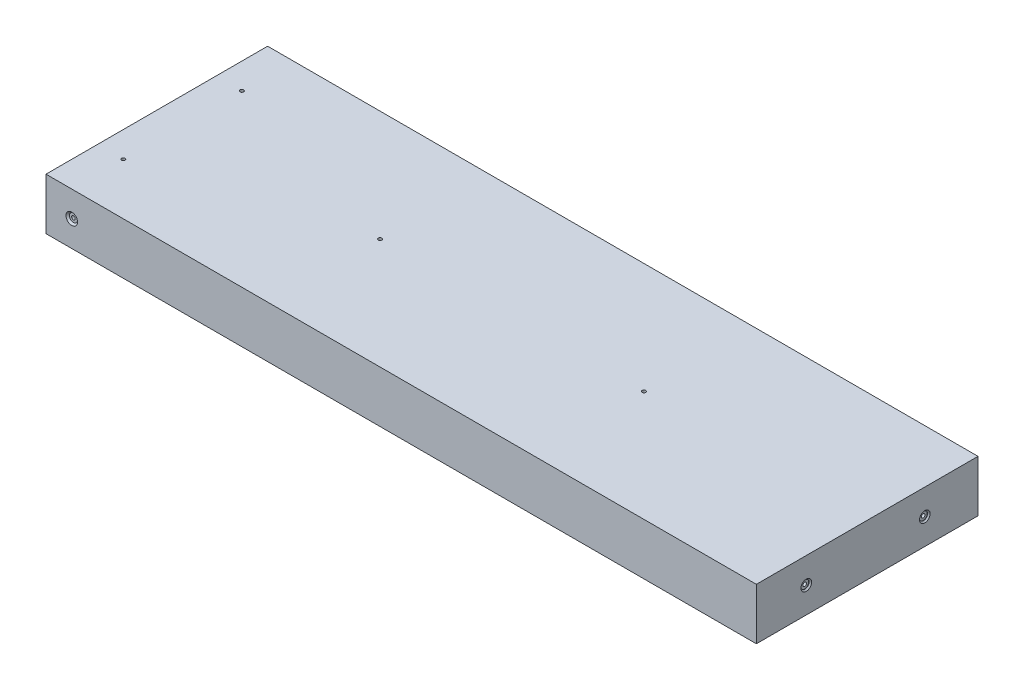
ISO-10303-21;
HEADER;
FILE_DESCRIPTION(('STEP AP214'),'2;1');
FILE_NAME('part.step','',(''),(''),'','','');
FILE_SCHEMA(('AUTOMOTIVE_DESIGN { 1 0 10303 214 1 1 1 1 }'));
ENDSEC;
DATA;
#1=APPLICATION_CONTEXT('core data for automotive mechanical design processes');
#2=APPLICATION_PROTOCOL_DEFINITION('international standard','automotive_design',2000,#1);
#3=PRODUCT_CONTEXT('',#1,'mechanical');
#4=PRODUCT('Part','Part','',(#3));
#5=PRODUCT_RELATED_PRODUCT_CATEGORY('part','',(#4));
#6=PRODUCT_DEFINITION_FORMATION('','',#4);
#7=PRODUCT_DEFINITION_CONTEXT('part definition',#1,'design');
#8=PRODUCT_DEFINITION('design','',#6,#7);
#9=PRODUCT_DEFINITION_SHAPE('','',#8);
#10=(LENGTH_UNIT() NAMED_UNIT(*) SI_UNIT(.MILLI.,.METRE.));
#11=(NAMED_UNIT(*) PLANE_ANGLE_UNIT() SI_UNIT($,.RADIAN.));
#12=(NAMED_UNIT(*) SI_UNIT($,.STERADIAN.) SOLID_ANGLE_UNIT());
#13=UNCERTAINTY_MEASURE_WITH_UNIT(LENGTH_MEASURE(1.E-05),#10,'distance_accuracy_value','');
#14=(GEOMETRIC_REPRESENTATION_CONTEXT(3) GLOBAL_UNCERTAINTY_ASSIGNED_CONTEXT((#13)) GLOBAL_UNIT_ASSIGNED_CONTEXT((#10,
#11,#12)) REPRESENTATION_CONTEXT('',''));
#15=CARTESIAN_POINT('',(0.,0.,0.));
#16=DIRECTION('',(0.,0.,1.));
#17=DIRECTION('',(1.,0.,0.));
#18=AXIS2_PLACEMENT_3D('',#15,#16,#17);
#19=CARTESIAN_POINT('',(-162.3,12.7,-54.6));
#20=DIRECTION('',(0.,0.,-1.));
#21=DIRECTION('',(-1.,0.,0.));
#22=AXIS2_PLACEMENT_3D('',#19,#20,#21);
#23=CYLINDRICAL_SURFACE('',#22,0.889000000000001);
#24=CARTESIAN_POINT('',(-162.3,12.7,-53.7872));
#25=DIRECTION('',(0.,0.,-1.));
#26=DIRECTION('',(-1.,0.,0.));
#27=AXIS2_PLACEMENT_3D('',#24,#25,#26);
#28=CIRCLE('',#27,0.889000000000001);
#29=CARTESIAN_POINT('',(-163.189,12.7,-53.7872));
#30=VERTEX_POINT('',#29);
#31=EDGE_CURVE('E177',#30,#30,#28,.T.);
#32=ORIENTED_EDGE('',*,*,#31,.T.);
#33=EDGE_LOOP('',(#32));
#34=FACE_BOUND('',#33,.T.);
#35=CARTESIAN_POINT('',(-162.3,12.7,-29.2));
#36=DIRECTION('',(0.,0.707106781186547,-0.707106781186547));
#37=DIRECTION('',(0.,-0.707106781186547,-0.707106781186547));
#38=AXIS2_PLACEMENT_3D('',#35,#36,#37);
#39=ELLIPSE('',#38,1.25723585694968,0.889000000000001);
#40=CARTESIAN_POINT('',(-163.189,12.7,-29.2));
#41=VERTEX_POINT('',#40);
#42=CARTESIAN_POINT('',(-161.411,12.7,-29.2));
#43=VERTEX_POINT('',#42);
#44=EDGE_CURVE('E46',#41,#43,#39,.F.);
#45=ORIENTED_EDGE('',*,*,#44,.T.);
#46=CARTESIAN_POINT('',(-162.3,12.7,-29.2));
#47=DIRECTION('',(0.,-0.707106781186547,-0.707106781186547));
#48=DIRECTION('',(0.,0.707106781186547,-0.707106781186547));
#49=AXIS2_PLACEMENT_3D('',#46,#47,#48);
#50=ELLIPSE('',#49,1.25723585694968,0.889000000000001);
#51=EDGE_CURVE('E11',#43,#41,#50,.F.);
#52=ORIENTED_EDGE('',*,*,#51,.T.);
#53=EDGE_LOOP('',(#45,#52));
#54=FACE_BOUND('',#53,.T.);
#55=ADVANCED_FACE('F33',(#34,#54),#23,.F.);
#56=CARTESIAN_POINT('',(-162.3,12.7,54.6));
#57=DIRECTION('',(0.,0.,1.));
#58=DIRECTION('',(1.,0.,0.));
#59=AXIS2_PLACEMENT_3D('',#56,#57,#58);
#60=CYLINDRICAL_SURFACE('',#59,0.889000000000001);
#61=CARTESIAN_POINT('',(-162.3,12.7,53.7872));
#62=DIRECTION('',(0.,0.,1.));
#63=DIRECTION('',(1.,0.,0.));
#64=AXIS2_PLACEMENT_3D('',#61,#62,#63);
#65=CIRCLE('',#64,0.889000000000001);
#66=CARTESIAN_POINT('',(-161.411,12.7,53.7872));
#67=VERTEX_POINT('',#66);
#68=EDGE_CURVE('E162',#67,#67,#65,.T.);
#69=ORIENTED_EDGE('',*,*,#68,.T.);
#70=EDGE_LOOP('',(#69));
#71=FACE_BOUND('',#70,.T.);
#72=CARTESIAN_POINT('',(-162.3,12.7,29.2));
#73=DIRECTION('',(0.,0.707106781186547,0.707106781186547));
#74=DIRECTION('',(0.,-0.707106781186547,0.707106781186547));
#75=AXIS2_PLACEMENT_3D('',#72,#73,#74);
#76=ELLIPSE('',#75,1.25723585694968,0.889000000000001);
#77=CARTESIAN_POINT('',(-161.411,12.7,29.2));
#78=VERTEX_POINT('',#77);
#79=CARTESIAN_POINT('',(-163.189,12.7,29.2));
#80=VERTEX_POINT('',#79);
#81=EDGE_CURVE('E53',#78,#80,#76,.F.);
#82=ORIENTED_EDGE('',*,*,#81,.T.);
#83=CARTESIAN_POINT('',(-162.3,12.7,29.2));
#84=DIRECTION('',(0.,-0.707106781186547,0.707106781186547));
#85=DIRECTION('',(0.,0.707106781186547,0.707106781186547));
#86=AXIS2_PLACEMENT_3D('',#83,#84,#85);
#87=ELLIPSE('',#86,1.25723585694968,0.889000000000001);
#88=EDGE_CURVE('E106',#80,#78,#87,.F.);
#89=ORIENTED_EDGE('',*,*,#88,.T.);
#90=EDGE_LOOP('',(#82,#89));
#91=FACE_BOUND('',#90,.T.);
#92=ADVANCED_FACE('F313',(#71,#91),#60,.F.);
#93=CARTESIAN_POINT('',(175.,25.4,-54.6));
#94=DIRECTION('',(-1.,0.,0.));
#95=DIRECTION('',(0.,0.,1.));
#96=AXIS2_PLACEMENT_3D('',#93,#94,#95);
#97=PLANE('',#96);
#98=CARTESIAN_POINT('',(175.,12.7,30.));
#99=DIRECTION('',(1.,0.,0.));
#100=DIRECTION('',(0.,0.,-1.));
#101=AXIS2_PLACEMENT_3D('',#98,#99,#100);
#102=CIRCLE('',#101,2.62001);
#103=CARTESIAN_POINT('',(175.,12.7,27.37999));
#104=VERTEX_POINT('',#103);
#105=EDGE_CURVE('E128',#104,#104,#102,.T.);
#106=ORIENTED_EDGE('',*,*,#105,.F.);
#107=EDGE_LOOP('',(#106));
#108=FACE_BOUND('',#107,.T.);
#109=CARTESIAN_POINT('',(175.,12.7,-28.4));
#110=DIRECTION('',(1.,0.,0.));
#111=DIRECTION('',(0.,0.,-1.));
#112=AXIS2_PLACEMENT_3D('',#109,#110,#111);
#113=CIRCLE('',#112,2.62001);
#114=CARTESIAN_POINT('',(175.,12.7,-31.02001));
#115=VERTEX_POINT('',#114);
#116=EDGE_CURVE('E201',#115,#115,#113,.T.);
#117=ORIENTED_EDGE('',*,*,#116,.F.);
#118=EDGE_LOOP('',(#117));
#119=FACE_BOUND('',#118,.T.);
#120=DIRECTION('',(0.,0.,-1.));
#121=VECTOR('',#120,1.);
#122=CARTESIAN_POINT('',(175.,0.,-54.6));
#123=LINE('',#122,#121);
#124=CARTESIAN_POINT('',(175.,0.,54.6));
#125=VERTEX_POINT('',#124);
#126=CARTESIAN_POINT('',(175.,0.,-54.6));
#127=VERTEX_POINT('',#126);
#128=EDGE_CURVE('E149',#125,#127,#123,.T.);
#129=ORIENTED_EDGE('',*,*,#128,.T.);
#130=DIRECTION('',(0.,-1.,0.));
#131=VECTOR('',#130,1.);
#132=CARTESIAN_POINT('',(175.,25.4,-54.6));
#133=LINE('',#132,#131);
#134=CARTESIAN_POINT('',(175.,25.4,-54.6));
#135=VERTEX_POINT('',#134);
#136=EDGE_CURVE('E119',#135,#127,#133,.T.);
#137=ORIENTED_EDGE('',*,*,#136,.F.);
#138=DIRECTION('',(0.,0.,-1.));
#139=VECTOR('',#138,1.);
#140=CARTESIAN_POINT('',(175.,25.4,-54.6));
#141=LINE('',#140,#139);
#142=CARTESIAN_POINT('',(175.,25.4,54.6));
#143=VERTEX_POINT('',#142);
#144=EDGE_CURVE('E144',#143,#135,#141,.T.);
#145=ORIENTED_EDGE('',*,*,#144,.F.);
#146=DIRECTION('',(0.,-1.,0.));
#147=VECTOR('',#146,1.);
#148=CARTESIAN_POINT('',(175.,25.4,54.6));
#149=LINE('',#148,#147);
#150=EDGE_CURVE('E138',#143,#125,#149,.T.);
#151=ORIENTED_EDGE('',*,*,#150,.T.);
#152=EDGE_LOOP('',(#129,#137,#145,#151));
#153=FACE_BOUND('',#152,.T.);
#154=ADVANCED_FACE('F35',(#108,#119,#153),#97,.F.);
#155=CARTESIAN_POINT('',(-175.,25.4,-54.6));
#156=DIRECTION('',(0.,0.,1.));
#157=DIRECTION('',(1.,0.,0.));
#158=AXIS2_PLACEMENT_3D('',#155,#156,#157);
#159=PLANE('',#158);
#160=CARTESIAN_POINT('',(-162.3,12.7,-54.6));
#161=DIRECTION('',(0.,0.,-1.));
#162=DIRECTION('',(-1.,0.,0.));
#163=AXIS2_PLACEMENT_3D('',#160,#161,#162);
#164=CIRCLE('',#163,2.85750000000001);
#165=CARTESIAN_POINT('',(-165.1575,12.7,-54.6));
#166=VERTEX_POINT('',#165);
#167=EDGE_CURVE('E186',#166,#166,#164,.T.);
#168=ORIENTED_EDGE('',*,*,#167,.F.);
#169=EDGE_LOOP('',(#168));
#170=FACE_BOUND('',#169,.T.);
#171=DIRECTION('',(-1.,0.,0.));
#172=VECTOR('',#171,1.);
#173=CARTESIAN_POINT('',(-175.,0.,-54.6));
#174=LINE('',#173,#172);
#175=CARTESIAN_POINT('',(-175.,0.,-54.6));
#176=VERTEX_POINT('',#175);
#177=EDGE_CURVE('E147',#127,#176,#174,.T.);
#178=ORIENTED_EDGE('',*,*,#177,.T.);
#179=DIRECTION('',(0.,-1.,0.));
#180=VECTOR('',#179,1.);
#181=CARTESIAN_POINT('',(-175.,25.4,-54.6));
#182=LINE('',#181,#180);
#183=CARTESIAN_POINT('',(-175.,25.4,-54.6));
#184=VERTEX_POINT('',#183);
#185=EDGE_CURVE('E132',#184,#176,#182,.T.);
#186=ORIENTED_EDGE('',*,*,#185,.F.);
#187=DIRECTION('',(-1.,0.,0.));
#188=VECTOR('',#187,1.);
#189=CARTESIAN_POINT('',(-175.,25.4,-54.6));
#190=LINE('',#189,#188);
#191=EDGE_CURVE('E156',#135,#184,#190,.T.);
#192=ORIENTED_EDGE('',*,*,#191,.F.);
#193=ORIENTED_EDGE('',*,*,#136,.T.);
#194=EDGE_LOOP('',(#178,#186,#192,#193));
#195=FACE_BOUND('',#194,.T.);
#196=ADVANCED_FACE('F300',(#170,#195),#159,.F.);
#197=CARTESIAN_POINT('',(-175.,25.4,-54.6));
#198=DIRECTION('',(1.,0.,0.));
#199=DIRECTION('',(0.,0.,-1.));
#200=AXIS2_PLACEMENT_3D('',#197,#198,#199);
#201=PLANE('',#200);
#202=DIRECTION('',(0.,0.,1.));
#203=VECTOR('',#202,1.);
#204=CARTESIAN_POINT('',(-175.,0.,-54.6));
#205=LINE('',#204,#203);
#206=CARTESIAN_POINT('',(-175.,0.,54.6));
#207=VERTEX_POINT('',#206);
#208=EDGE_CURVE('E145',#176,#207,#205,.T.);
#209=ORIENTED_EDGE('',*,*,#208,.T.);
#210=DIRECTION('',(0.,-1.,0.));
#211=VECTOR('',#210,1.);
#212=CARTESIAN_POINT('',(-175.,25.4,54.6));
#213=LINE('',#212,#211);
#214=CARTESIAN_POINT('',(-175.,25.4,54.6));
#215=VERTEX_POINT('',#214);
#216=EDGE_CURVE('E135',#215,#207,#213,.T.);
#217=ORIENTED_EDGE('',*,*,#216,.F.);
#218=DIRECTION('',(0.,0.,1.));
#219=VECTOR('',#218,1.);
#220=CARTESIAN_POINT('',(-175.,25.4,-54.6));
#221=LINE('',#220,#219);
#222=EDGE_CURVE('E154',#184,#215,#221,.T.);
#223=ORIENTED_EDGE('',*,*,#222,.F.);
#224=ORIENTED_EDGE('',*,*,#185,.T.);
#225=EDGE_LOOP('',(#209,#217,#223,#224));
#226=FACE_BOUND('',#225,.T.);
#227=ADVANCED_FACE('F297',(#226),#201,.F.);
#228=CARTESIAN_POINT('',(-175.,25.4,54.6));
#229=DIRECTION('',(0.,0.,-1.));
#230=DIRECTION('',(-1.,0.,0.));
#231=AXIS2_PLACEMENT_3D('',#228,#229,#230);
#232=PLANE('',#231);
#233=CARTESIAN_POINT('',(-162.3,12.7,54.6));
#234=DIRECTION('',(0.,0.,1.));
#235=DIRECTION('',(1.,0.,0.));
#236=AXIS2_PLACEMENT_3D('',#233,#234,#235);
#237=CIRCLE('',#236,2.85750000000001);
#238=CARTESIAN_POINT('',(-159.4425,12.7,54.6));
#239=VERTEX_POINT('',#238);
#240=EDGE_CURVE('E171',#239,#239,#237,.T.);
#241=ORIENTED_EDGE('',*,*,#240,.F.);
#242=EDGE_LOOP('',(#241));
#243=FACE_BOUND('',#242,.T.);
#244=DIRECTION('',(1.,0.,0.));
#245=VECTOR('',#244,1.);
#246=CARTESIAN_POINT('',(-175.,0.,54.6));
#247=LINE('',#246,#245);
#248=EDGE_CURVE('E142',#207,#125,#247,.T.);
#249=ORIENTED_EDGE('',*,*,#248,.T.);
#250=ORIENTED_EDGE('',*,*,#150,.F.);
#251=DIRECTION('',(1.,0.,0.));
#252=VECTOR('',#251,1.);
#253=CARTESIAN_POINT('',(-175.,25.4,54.6));
#254=LINE('',#253,#252);
#255=EDGE_CURVE('E141',#215,#143,#254,.T.);
#256=ORIENTED_EDGE('',*,*,#255,.F.);
#257=ORIENTED_EDGE('',*,*,#216,.T.);
#258=EDGE_LOOP('',(#249,#250,#256,#257));
#259=FACE_BOUND('',#258,.T.);
#260=ADVANCED_FACE('F293',(#243,#259),#232,.F.);
#261=CARTESIAN_POINT('',(0.,25.4,0.));
#262=DIRECTION('',(0.,1.,0.));
#263=DIRECTION('',(0.,0.,1.));
#264=AXIS2_PLACEMENT_3D('',#261,#262,#263);
#265=PLANE('',#264);
#266=CARTESIAN_POINT('',(-162.3,25.4,-29.2));
#267=DIRECTION('',(0.,-1.,0.));
#268=DIRECTION('',(0.,0.,-1.));
#269=AXIS2_PLACEMENT_3D('',#266,#267,#268);
#270=CIRCLE('',#269,0.889000000000001);
#271=CARTESIAN_POINT('',(-162.3,25.4,-30.089));
#272=VERTEX_POINT('',#271);
#273=EDGE_CURVE('E254',#272,#272,#270,.T.);
#274=ORIENTED_EDGE('',*,*,#273,.T.);
#275=EDGE_LOOP('',(#274));
#276=FACE_BOUND('',#275,.T.);
#277=CARTESIAN_POINT('',(-162.3,25.4,29.2));
#278=DIRECTION('',(0.,-1.,0.));
#279=DIRECTION('',(0.,0.,-1.));
#280=AXIS2_PLACEMENT_3D('',#277,#278,#279);
#281=CIRCLE('',#280,0.889000000000001);
#282=CARTESIAN_POINT('',(-162.3,25.4,28.311));
#283=VERTEX_POINT('',#282);
#284=EDGE_CURVE('E239',#283,#283,#281,.T.);
#285=ORIENTED_EDGE('',*,*,#284,.T.);
#286=EDGE_LOOP('',(#285));
#287=FACE_BOUND('',#286,.T.);
#288=CARTESIAN_POINT('',(-65.,25.4,0.));
#289=DIRECTION('',(0.,1.,0.));
#290=DIRECTION('',(0.,0.,1.));
#291=AXIS2_PLACEMENT_3D('',#288,#289,#290);
#292=CIRCLE('',#291,0.888999999999987);
#293=CARTESIAN_POINT('',(-65.,25.4,0.888999999999999));
#294=VERTEX_POINT('',#293);
#295=EDGE_CURVE('E120',#294,#294,#292,.T.);
#296=ORIENTED_EDGE('',*,*,#295,.F.);
#297=EDGE_LOOP('',(#296));
#298=FACE_BOUND('',#297,.T.);
#299=CARTESIAN_POINT('',(65.,25.4,0.));
#300=DIRECTION('',(0.,1.,0.));
#301=DIRECTION('',(0.,0.,1.));
#302=AXIS2_PLACEMENT_3D('',#299,#300,#301);
#303=CIRCLE('',#302,0.888999999999987);
#304=CARTESIAN_POINT('',(65.,25.4,0.889000000000015));
#305=VERTEX_POINT('',#304);
#306=EDGE_CURVE('E125',#305,#305,#303,.T.);
#307=ORIENTED_EDGE('',*,*,#306,.F.);
#308=EDGE_LOOP('',(#307));
#309=FACE_BOUND('',#308,.T.);
#310=ORIENTED_EDGE('',*,*,#144,.T.);
#311=ORIENTED_EDGE('',*,*,#191,.T.);
#312=ORIENTED_EDGE('',*,*,#222,.T.);
#313=ORIENTED_EDGE('',*,*,#255,.T.);
#314=EDGE_LOOP('',(#310,#311,#312,#313));
#315=FACE_BOUND('',#314,.T.);
#316=ADVANCED_FACE('F276',(#276,#287,#298,#309,#315),#265,.T.);
#317=CARTESIAN_POINT('',(0.,0.,0.));
#318=DIRECTION('',(0.,1.,0.));
#319=DIRECTION('',(0.,0.,1.));
#320=AXIS2_PLACEMENT_3D('',#317,#318,#319);
#321=PLANE('',#320);
#322=CARTESIAN_POINT('',(-162.3,0.,-29.2));
#323=DIRECTION('',(0.,-1.,0.));
#324=DIRECTION('',(0.,0.,-1.));
#325=AXIS2_PLACEMENT_3D('',#322,#323,#324);
#326=CIRCLE('',#325,2.85750000000001);
#327=CARTESIAN_POINT('',(-162.3,0.,-32.0575));
#328=VERTEX_POINT('',#327);
#329=EDGE_CURVE('E266',#328,#328,#326,.T.);
#330=ORIENTED_EDGE('',*,*,#329,.F.);
#331=EDGE_LOOP('',(#330));
#332=FACE_BOUND('',#331,.T.);
#333=CARTESIAN_POINT('',(-162.3,0.,29.2));
#334=DIRECTION('',(0.,-1.,0.));
#335=DIRECTION('',(0.,0.,-1.));
#336=AXIS2_PLACEMENT_3D('',#333,#334,#335);
#337=CIRCLE('',#336,2.85750000000001);
#338=CARTESIAN_POINT('',(-162.3,0.,26.3425));
#339=VERTEX_POINT('',#338);
#340=EDGE_CURVE('E251',#339,#339,#337,.T.);
#341=ORIENTED_EDGE('',*,*,#340,.F.);
#342=EDGE_LOOP('',(#341));
#343=FACE_BOUND('',#342,.T.);
#344=CARTESIAN_POINT('',(-65.,0.,0.));
#345=DIRECTION('',(0.,-1.,0.));
#346=DIRECTION('',(0.,0.,-1.));
#347=AXIS2_PLACEMENT_3D('',#344,#345,#346);
#348=CIRCLE('',#347,2.8575);
#349=CARTESIAN_POINT('',(-65.,0.,-2.85749999999999));
#350=VERTEX_POINT('',#349);
#351=EDGE_CURVE('E236',#350,#350,#348,.T.);
#352=ORIENTED_EDGE('',*,*,#351,.F.);
#353=EDGE_LOOP('',(#352));
#354=FACE_BOUND('',#353,.T.);
#355=CARTESIAN_POINT('',(65.,0.,0.));
#356=DIRECTION('',(0.,-1.,0.));
#357=DIRECTION('',(0.,0.,-1.));
#358=AXIS2_PLACEMENT_3D('',#355,#356,#357);
#359=CIRCLE('',#358,2.8575);
#360=CARTESIAN_POINT('',(65.,0.,-2.85749999999997));
#361=VERTEX_POINT('',#360);
#362=EDGE_CURVE('E123',#361,#361,#359,.T.);
#363=ORIENTED_EDGE('',*,*,#362,.F.);
#364=EDGE_LOOP('',(#363));
#365=FACE_BOUND('',#364,.T.);
#366=ORIENTED_EDGE('',*,*,#128,.F.);
#367=ORIENTED_EDGE('',*,*,#248,.F.);
#368=ORIENTED_EDGE('',*,*,#208,.F.);
#369=ORIENTED_EDGE('',*,*,#177,.F.);
#370=EDGE_LOOP('',(#366,#367,#368,#369));
#371=FACE_BOUND('',#370,.T.);
#372=ADVANCED_FACE('F272',(#332,#343,#354,#365,#371),#321,.F.);
#373=CARTESIAN_POINT('',(-161.411,12.7,53.7872));
#374=DIRECTION('',(0.,0.,-1.));
#375=DIRECTION('',(-1.,0.,0.));
#376=AXIS2_PLACEMENT_3D('',#373,#374,#375);
#377=PLANE('',#376);
#378=ORIENTED_EDGE('',*,*,#68,.F.);
#379=EDGE_LOOP('',(#378));
#380=FACE_BOUND('',#379,.T.);
#381=CARTESIAN_POINT('',(-162.3,12.7,53.7872));
#382=DIRECTION('',(0.,0.,1.));
#383=DIRECTION('',(1.,0.,0.));
#384=AXIS2_PLACEMENT_3D('',#381,#382,#383);
#385=CIRCLE('',#384,1.98501000000001);
#386=CARTESIAN_POINT('',(-160.31499,12.7,53.7872));
#387=VERTEX_POINT('',#386);
#388=EDGE_CURVE('E165',#387,#387,#385,.T.);
#389=ORIENTED_EDGE('',*,*,#388,.T.);
#390=EDGE_LOOP('',(#389));
#391=FACE_BOUND('',#390,.T.);
#392=ADVANCED_FACE('F275',(#380,#391),#377,.F.);
#393=CARTESIAN_POINT('',(-162.3,12.7,54.6));
#394=DIRECTION('',(0.,0.,1.));
#395=DIRECTION('',(1.,0.,0.));
#396=AXIS2_PLACEMENT_3D('',#393,#394,#395);
#397=CYLINDRICAL_SURFACE('',#396,1.98501000000001);
#398=ORIENTED_EDGE('',*,*,#388,.F.);
#399=EDGE_LOOP('',(#398));
#400=FACE_BOUND('',#399,.T.);
#401=CARTESIAN_POINT('',(-162.3,12.7,53.72751));
#402=DIRECTION('',(0.,0.,1.));
#403=DIRECTION('',(1.,0.,0.));
#404=AXIS2_PLACEMENT_3D('',#401,#402,#403);
#405=CIRCLE('',#404,1.98501000000001);
#406=CARTESIAN_POINT('',(-160.31499,12.7,53.72751));
#407=VERTEX_POINT('',#406);
#408=EDGE_CURVE('E168',#407,#407,#405,.T.);
#409=ORIENTED_EDGE('',*,*,#408,.T.);
#410=EDGE_LOOP('',(#409));
#411=FACE_BOUND('',#410,.T.);
#412=ADVANCED_FACE('F344',(#400,#411),#397,.T.);
#413=CARTESIAN_POINT('',(-162.3,12.7,54.6));
#414=DIRECTION('',(0.,0.,1.));
#415=DIRECTION('',(1.,0.,0.));
#416=AXIS2_PLACEMENT_3D('',#413,#414,#415);
#417=CONICAL_SURFACE('',#416,2.85750000000001,0.785398163397452);
#418=ORIENTED_EDGE('',*,*,#408,.F.);
#419=EDGE_LOOP('',(#418));
#420=FACE_BOUND('',#419,.T.);
#421=ORIENTED_EDGE('',*,*,#240,.T.);
#422=EDGE_LOOP('',(#421));
#423=FACE_BOUND('',#422,.T.);
#424=ADVANCED_FACE('F340',(#420,#423),#417,.F.);
#425=CARTESIAN_POINT('',(-161.411,12.7,-53.7872));
#426=DIRECTION('',(0.,0.,1.));
#427=DIRECTION('',(1.,0.,0.));
#428=AXIS2_PLACEMENT_3D('',#425,#426,#427);
#429=PLANE('',#428);
#430=ORIENTED_EDGE('',*,*,#31,.F.);
#431=EDGE_LOOP('',(#430));
#432=FACE_BOUND('',#431,.T.);
#433=CARTESIAN_POINT('',(-162.3,12.7,-53.7872));
#434=DIRECTION('',(0.,0.,-1.));
#435=DIRECTION('',(-1.,0.,0.));
#436=AXIS2_PLACEMENT_3D('',#433,#434,#435);
#437=CIRCLE('',#436,1.98501000000001);
#438=CARTESIAN_POINT('',(-164.28501,12.7,-53.7872));
#439=VERTEX_POINT('',#438);
#440=EDGE_CURVE('E180',#439,#439,#437,.T.);
#441=ORIENTED_EDGE('',*,*,#440,.T.);
#442=EDGE_LOOP('',(#441));
#443=FACE_BOUND('',#442,.T.);
#444=ADVANCED_FACE('F343',(#432,#443),#429,.F.);
#445=CARTESIAN_POINT('',(-162.3,12.7,-54.6));
#446=DIRECTION('',(0.,0.,-1.));
#447=DIRECTION('',(-1.,0.,0.));
#448=AXIS2_PLACEMENT_3D('',#445,#446,#447);
#449=CYLINDRICAL_SURFACE('',#448,1.98501000000001);
#450=ORIENTED_EDGE('',*,*,#440,.F.);
#451=EDGE_LOOP('',(#450));
#452=FACE_BOUND('',#451,.T.);
#453=CARTESIAN_POINT('',(-162.3,12.7,-53.72751));
#454=DIRECTION('',(0.,0.,-1.));
#455=DIRECTION('',(-1.,0.,0.));
#456=AXIS2_PLACEMENT_3D('',#453,#454,#455);
#457=CIRCLE('',#456,1.98501000000001);
#458=CARTESIAN_POINT('',(-164.28501,12.7,-53.72751));
#459=VERTEX_POINT('',#458);
#460=EDGE_CURVE('E183',#459,#459,#457,.T.);
#461=ORIENTED_EDGE('',*,*,#460,.T.);
#462=EDGE_LOOP('',(#461));
#463=FACE_BOUND('',#462,.T.);
#464=ADVANCED_FACE('F465',(#452,#463),#449,.T.);
#465=CARTESIAN_POINT('',(-162.3,12.7,-54.6));
#466=DIRECTION('',(0.,0.,-1.));
#467=DIRECTION('',(-1.,0.,0.));
#468=AXIS2_PLACEMENT_3D('',#465,#466,#467);
#469=CONICAL_SURFACE('',#468,2.85750000000001,0.785398163397452);
#470=ORIENTED_EDGE('',*,*,#460,.F.);
#471=EDGE_LOOP('',(#470));
#472=FACE_BOUND('',#471,.T.);
#473=ORIENTED_EDGE('',*,*,#167,.T.);
#474=EDGE_LOOP('',(#473));
#475=FACE_BOUND('',#474,.T.);
#476=ADVANCED_FACE('F461',(#472,#475),#469,.F.);
#477=CARTESIAN_POINT('',(145.,12.7,-28.4));
#478=DIRECTION('',(1.,0.,0.));
#479=DIRECTION('',(0.,0.,-1.));
#480=AXIS2_PLACEMENT_3D('',#477,#478,#479);
#481=CONICAL_SURFACE('',#480,0.888999999999992,1.02974425867664);
#482=CARTESIAN_POINT('',(144.465834909684,12.7,-28.4));
#483=VERTEX_POINT('',#482);
#484=VERTEX_LOOP('',#483);
#485=FACE_BOUND('',#484,.T.);
#486=CARTESIAN_POINT('',(145.,12.7,-28.4));
#487=DIRECTION('',(1.,0.,0.));
#488=DIRECTION('',(0.,0.,-1.));
#489=AXIS2_PLACEMENT_3D('',#486,#487,#488);
#490=CIRCLE('',#489,0.888999999999992);
#491=CARTESIAN_POINT('',(145.,12.7,-29.289));
#492=VERTEX_POINT('',#491);
#493=EDGE_CURVE('E189',#492,#492,#490,.T.);
#494=ORIENTED_EDGE('',*,*,#493,.T.);
#495=EDGE_LOOP('',(#494));
#496=FACE_BOUND('',#495,.T.);
#497=ADVANCED_FACE('F457',(#485,#496),#481,.F.);
#498=CARTESIAN_POINT('',(175.,12.7,-28.4));
#499=DIRECTION('',(1.,0.,0.));
#500=DIRECTION('',(0.,0.,-1.));
#501=AXIS2_PLACEMENT_3D('',#498,#499,#500);
#502=CYLINDRICAL_SURFACE('',#501,0.888999999999994);
#503=ORIENTED_EDGE('',*,*,#493,.F.);
#504=EDGE_LOOP('',(#503));
#505=FACE_BOUND('',#504,.T.);
#506=CARTESIAN_POINT('',(174.1872,12.7,-28.4));
#507=DIRECTION('',(1.,0.,0.));
#508=DIRECTION('',(0.,0.,-1.));
#509=AXIS2_PLACEMENT_3D('',#506,#507,#508);
#510=CIRCLE('',#509,0.888999999999996);
#511=CARTESIAN_POINT('',(174.1872,12.7,-29.289));
#512=VERTEX_POINT('',#511);
#513=EDGE_CURVE('E192',#512,#512,#510,.T.);
#514=ORIENTED_EDGE('',*,*,#513,.T.);
#515=EDGE_LOOP('',(#514));
#516=FACE_BOUND('',#515,.T.);
#517=ADVANCED_FACE('F453',(#505,#516),#502,.F.);
#518=CARTESIAN_POINT('',(174.1872,13.589,-28.4));
#519=DIRECTION('',(-1.,0.,0.));
#520=DIRECTION('',(0.,0.,1.));
#521=AXIS2_PLACEMENT_3D('',#518,#519,#520);
#522=PLANE('',#521);
#523=ORIENTED_EDGE('',*,*,#513,.F.);
#524=EDGE_LOOP('',(#523));
#525=FACE_BOUND('',#524,.T.);
#526=CARTESIAN_POINT('',(174.1872,12.7,-28.4));
#527=DIRECTION('',(1.,0.,0.));
#528=DIRECTION('',(0.,0.,-1.));
#529=AXIS2_PLACEMENT_3D('',#526,#527,#528);
#530=CIRCLE('',#529,1.98501);
#531=CARTESIAN_POINT('',(174.1872,12.7,-30.38501));
#532=VERTEX_POINT('',#531);
#533=EDGE_CURVE('E195',#532,#532,#530,.T.);
#534=ORIENTED_EDGE('',*,*,#533,.T.);
#535=EDGE_LOOP('',(#534));
#536=FACE_BOUND('',#535,.T.);
#537=ADVANCED_FACE('F449',(#525,#536),#522,.F.);
#538=CARTESIAN_POINT('',(175.,12.7,-28.4));
#539=DIRECTION('',(1.,0.,0.));
#540=DIRECTION('',(0.,0.,-1.));
#541=AXIS2_PLACEMENT_3D('',#538,#539,#540);
#542=CYLINDRICAL_SURFACE('',#541,1.98501);
#543=ORIENTED_EDGE('',*,*,#533,.F.);
#544=EDGE_LOOP('',(#543));
#545=FACE_BOUND('',#544,.T.);
#546=CARTESIAN_POINT('',(174.365,12.7,-28.4));
#547=DIRECTION('',(1.,0.,0.));
#548=DIRECTION('',(0.,0.,-1.));
#549=AXIS2_PLACEMENT_3D('',#546,#547,#548);
#550=CIRCLE('',#549,1.98501);
#551=CARTESIAN_POINT('',(174.365,12.7,-30.38501));
#552=VERTEX_POINT('',#551);
#553=EDGE_CURVE('E198',#552,#552,#550,.T.);
#554=ORIENTED_EDGE('',*,*,#553,.T.);
#555=EDGE_LOOP('',(#554));
#556=FACE_BOUND('',#555,.T.);
#557=ADVANCED_FACE('F445',(#545,#556),#542,.F.);
#558=CARTESIAN_POINT('',(175.,12.7,-28.4));
#559=DIRECTION('',(1.,0.,0.));
#560=DIRECTION('',(0.,0.,-1.));
#561=AXIS2_PLACEMENT_3D('',#558,#559,#560);
#562=CONICAL_SURFACE('',#561,2.62001,0.785398163397451);
#563=ORIENTED_EDGE('',*,*,#553,.F.);
#564=EDGE_LOOP('',(#563));
#565=FACE_BOUND('',#564,.T.);
#566=ORIENTED_EDGE('',*,*,#116,.T.);
#567=EDGE_LOOP('',(#566));
#568=FACE_BOUND('',#567,.T.);
#569=ADVANCED_FACE('F441',(#565,#568),#562,.F.);
#570=CARTESIAN_POINT('',(145.,12.7,30.));
#571=DIRECTION('',(1.,0.,0.));
#572=DIRECTION('',(0.,0.,-1.));
#573=AXIS2_PLACEMENT_3D('',#570,#571,#572);
#574=CONICAL_SURFACE('',#573,0.888999999999992,1.02974425867664);
#575=CARTESIAN_POINT('',(144.465834909684,12.7,30.));
#576=VERTEX_POINT('',#575);
#577=VERTEX_LOOP('',#576);
#578=FACE_BOUND('',#577,.T.);
#579=CARTESIAN_POINT('',(145.,12.7,30.));
#580=DIRECTION('',(1.,0.,0.));
#581=DIRECTION('',(0.,0.,-1.));
#582=AXIS2_PLACEMENT_3D('',#579,#580,#581);
#583=CIRCLE('',#582,0.888999999999992);
#584=CARTESIAN_POINT('',(145.,12.7,29.111));
#585=VERTEX_POINT('',#584);
#586=EDGE_CURVE('E204',#585,#585,#583,.T.);
#587=ORIENTED_EDGE('',*,*,#586,.T.);
#588=EDGE_LOOP('',(#587));
#589=FACE_BOUND('',#588,.T.);
#590=ADVANCED_FACE('F437',(#578,#589),#574,.F.);
#591=CARTESIAN_POINT('',(175.,12.7,30.));
#592=DIRECTION('',(1.,0.,0.));
#593=DIRECTION('',(0.,0.,-1.));
#594=AXIS2_PLACEMENT_3D('',#591,#592,#593);
#595=CYLINDRICAL_SURFACE('',#594,0.888999999999994);
#596=ORIENTED_EDGE('',*,*,#586,.F.);
#597=EDGE_LOOP('',(#596));
#598=FACE_BOUND('',#597,.T.);
#599=CARTESIAN_POINT('',(174.1872,12.7,30.));
#600=DIRECTION('',(1.,0.,0.));
#601=DIRECTION('',(0.,0.,-1.));
#602=AXIS2_PLACEMENT_3D('',#599,#600,#601);
#603=CIRCLE('',#602,0.888999999999996);
#604=CARTESIAN_POINT('',(174.1872,12.7,29.111));
#605=VERTEX_POINT('',#604);
#606=EDGE_CURVE('E207',#605,#605,#603,.T.);
#607=ORIENTED_EDGE('',*,*,#606,.T.);
#608=EDGE_LOOP('',(#607));
#609=FACE_BOUND('',#608,.T.);
#610=ADVANCED_FACE('F433',(#598,#609),#595,.F.);
#611=CARTESIAN_POINT('',(174.1872,13.589,30.));
#612=DIRECTION('',(-1.,0.,0.));
#613=DIRECTION('',(0.,0.,1.));
#614=AXIS2_PLACEMENT_3D('',#611,#612,#613);
#615=PLANE('',#614);
#616=ORIENTED_EDGE('',*,*,#606,.F.);
#617=EDGE_LOOP('',(#616));
#618=FACE_BOUND('',#617,.T.);
#619=CARTESIAN_POINT('',(174.1872,12.7,30.));
#620=DIRECTION('',(1.,0.,0.));
#621=DIRECTION('',(0.,0.,-1.));
#622=AXIS2_PLACEMENT_3D('',#619,#620,#621);
#623=CIRCLE('',#622,1.98501);
#624=CARTESIAN_POINT('',(174.1872,12.7,28.01499));
#625=VERTEX_POINT('',#624);
#626=EDGE_CURVE('E210',#625,#625,#623,.T.);
#627=ORIENTED_EDGE('',*,*,#626,.T.);
#628=EDGE_LOOP('',(#627));
#629=FACE_BOUND('',#628,.T.);
#630=ADVANCED_FACE('F429',(#618,#629),#615,.F.);
#631=CARTESIAN_POINT('',(175.,12.7,30.));
#632=DIRECTION('',(1.,0.,0.));
#633=DIRECTION('',(0.,0.,-1.));
#634=AXIS2_PLACEMENT_3D('',#631,#632,#633);
#635=CYLINDRICAL_SURFACE('',#634,1.98501);
#636=ORIENTED_EDGE('',*,*,#626,.F.);
#637=EDGE_LOOP('',(#636));
#638=FACE_BOUND('',#637,.T.);
#639=CARTESIAN_POINT('',(174.365,12.7,30.));
#640=DIRECTION('',(1.,0.,0.));
#641=DIRECTION('',(0.,0.,-1.));
#642=AXIS2_PLACEMENT_3D('',#639,#640,#641);
#643=CIRCLE('',#642,1.98501);
#644=CARTESIAN_POINT('',(174.365,12.7,28.01499));
#645=VERTEX_POINT('',#644);
#646=EDGE_CURVE('E213',#645,#645,#643,.T.);
#647=ORIENTED_EDGE('',*,*,#646,.T.);
#648=EDGE_LOOP('',(#647));
#649=FACE_BOUND('',#648,.T.);
#650=ADVANCED_FACE('F425',(#638,#649),#635,.F.);
#651=CARTESIAN_POINT('',(175.,12.7,30.));
#652=DIRECTION('',(1.,0.,0.));
#653=DIRECTION('',(0.,0.,-1.));
#654=AXIS2_PLACEMENT_3D('',#651,#652,#653);
#655=CONICAL_SURFACE('',#654,2.62001,0.785398163397451);
#656=ORIENTED_EDGE('',*,*,#646,.F.);
#657=EDGE_LOOP('',(#656));
#658=FACE_BOUND('',#657,.T.);
#659=ORIENTED_EDGE('',*,*,#105,.T.);
#660=EDGE_LOOP('',(#659));
#661=FACE_BOUND('',#660,.T.);
#662=ADVANCED_FACE('F395',(#658,#661),#655,.F.);
#663=CARTESIAN_POINT('',(65.,0.,0.));
#664=DIRECTION('',(0.,-1.,0.));
#665=DIRECTION('',(0.,0.,-1.));
#666=AXIS2_PLACEMENT_3D('',#663,#664,#665);
#667=CYLINDRICAL_SURFACE('',#666,0.888999999999987);
#668=ORIENTED_EDGE('',*,*,#306,.T.);
#669=EDGE_LOOP('',(#668));
#670=FACE_BOUND('',#669,.T.);
#671=CARTESIAN_POINT('',(65.,0.812799999999996,0.));
#672=DIRECTION('',(0.,-1.,0.));
#673=DIRECTION('',(0.,0.,-1.));
#674=AXIS2_PLACEMENT_3D('',#671,#672,#673);
#675=CIRCLE('',#674,0.888999999999987);
#676=CARTESIAN_POINT('',(65.,0.812799999999996,-0.888999999999959));
#677=VERTEX_POINT('',#676);
#678=EDGE_CURVE('E129',#677,#677,#675,.T.);
#679=ORIENTED_EDGE('',*,*,#678,.T.);
#680=EDGE_LOOP('',(#679));
#681=FACE_BOUND('',#680,.T.);
#682=ADVANCED_FACE('F391',(#670,#681),#667,.F.);
#683=CARTESIAN_POINT('',(65.889,0.812799999999996,0.));
#684=DIRECTION('',(0.,1.,0.));
#685=DIRECTION('',(0.,0.,1.));
#686=AXIS2_PLACEMENT_3D('',#683,#684,#685);
#687=PLANE('',#686);
#688=ORIENTED_EDGE('',*,*,#678,.F.);
#689=EDGE_LOOP('',(#688));
#690=FACE_BOUND('',#689,.T.);
#691=CARTESIAN_POINT('',(65.,0.812799999999996,0.));
#692=DIRECTION('',(0.,-1.,0.));
#693=DIRECTION('',(0.,0.,-1.));
#694=AXIS2_PLACEMENT_3D('',#691,#692,#693);
#695=CIRCLE('',#694,1.98501);
#696=CARTESIAN_POINT('',(65.,0.812799999999996,-1.98500999999997));
#697=VERTEX_POINT('',#696);
#698=EDGE_CURVE('E220',#697,#697,#695,.T.);
#699=ORIENTED_EDGE('',*,*,#698,.T.);
#700=EDGE_LOOP('',(#699));
#701=FACE_BOUND('',#700,.T.);
#702=ADVANCED_FACE('F394',(#690,#701),#687,.F.);
#703=CARTESIAN_POINT('',(65.,0.,0.));
#704=DIRECTION('',(0.,-1.,0.));
#705=DIRECTION('',(0.,0.,-1.));
#706=AXIS2_PLACEMENT_3D('',#703,#704,#705);
#707=CYLINDRICAL_SURFACE('',#706,1.98501);
#708=ORIENTED_EDGE('',*,*,#698,.F.);
#709=EDGE_LOOP('',(#708));
#710=FACE_BOUND('',#709,.T.);
#711=CARTESIAN_POINT('',(65.,0.87249,0.));
#712=DIRECTION('',(0.,-1.,0.));
#713=DIRECTION('',(0.,0.,-1.));
#714=AXIS2_PLACEMENT_3D('',#711,#712,#713);
#715=CIRCLE('',#714,1.98501);
#716=CARTESIAN_POINT('',(65.,0.87249,-1.98500999999997));
#717=VERTEX_POINT('',#716);
#718=EDGE_CURVE('E223',#717,#717,#715,.T.);
#719=ORIENTED_EDGE('',*,*,#718,.T.);
#720=EDGE_LOOP('',(#719));
#721=FACE_BOUND('',#720,.T.);
#722=ADVANCED_FACE('F401',(#710,#721),#707,.T.);
#723=CARTESIAN_POINT('',(65.,0.,0.));
#724=DIRECTION('',(0.,-1.,0.));
#725=DIRECTION('',(0.,0.,-1.));
#726=AXIS2_PLACEMENT_3D('',#723,#724,#725);
#727=CONICAL_SURFACE('',#726,2.8575,0.785398163397449);
#728=ORIENTED_EDGE('',*,*,#718,.F.);
#729=EDGE_LOOP('',(#728));
#730=FACE_BOUND('',#729,.T.);
#731=ORIENTED_EDGE('',*,*,#362,.T.);
#732=EDGE_LOOP('',(#731));
#733=FACE_BOUND('',#732,.T.);
#734=ADVANCED_FACE('F407',(#730,#733),#727,.F.);
#735=CARTESIAN_POINT('',(-65.,0.,0.));
#736=DIRECTION('',(0.,-1.,0.));
#737=DIRECTION('',(0.,0.,-1.));
#738=AXIS2_PLACEMENT_3D('',#735,#736,#737);
#739=CYLINDRICAL_SURFACE('',#738,0.888999999999987);
#740=ORIENTED_EDGE('',*,*,#295,.T.);
#741=EDGE_LOOP('',(#740));
#742=FACE_BOUND('',#741,.T.);
#743=CARTESIAN_POINT('',(-65.,0.812799999999996,0.));
#744=DIRECTION('',(0.,-1.,0.));
#745=DIRECTION('',(0.,0.,-1.));
#746=AXIS2_PLACEMENT_3D('',#743,#744,#745);
#747=CIRCLE('',#746,0.888999999999987);
#748=CARTESIAN_POINT('',(-65.,0.812799999999996,-0.888999999999975));
#749=VERTEX_POINT('',#748);
#750=EDGE_CURVE('E124',#749,#749,#747,.T.);
#751=ORIENTED_EDGE('',*,*,#750,.T.);
#752=EDGE_LOOP('',(#751));
#753=FACE_BOUND('',#752,.T.);
#754=ADVANCED_FACE('F413',(#742,#753),#739,.F.);
#755=CARTESIAN_POINT('',(-64.111,0.812799999999996,0.));
#756=DIRECTION('',(0.,1.,0.));
#757=DIRECTION('',(0.,0.,1.));
#758=AXIS2_PLACEMENT_3D('',#755,#756,#757);
#759=PLANE('',#758);
#760=ORIENTED_EDGE('',*,*,#750,.F.);
#761=EDGE_LOOP('',(#760));
#762=FACE_BOUND('',#761,.T.);
#763=CARTESIAN_POINT('',(-65.,0.812799999999996,0.));
#764=DIRECTION('',(0.,-1.,0.));
#765=DIRECTION('',(0.,0.,-1.));
#766=AXIS2_PLACEMENT_3D('',#763,#764,#765);
#767=CIRCLE('',#766,1.98501);
#768=CARTESIAN_POINT('',(-65.,0.812799999999996,-1.98500999999998));
#769=VERTEX_POINT('',#768);
#770=EDGE_CURVE('E230',#769,#769,#767,.T.);
#771=ORIENTED_EDGE('',*,*,#770,.T.);
#772=EDGE_LOOP('',(#771));
#773=FACE_BOUND('',#772,.T.);
#774=ADVANCED_FACE('F418',(#762,#773),#759,.F.);
#775=CARTESIAN_POINT('',(-65.,0.,0.));
#776=DIRECTION('',(0.,-1.,0.));
#777=DIRECTION('',(0.,0.,-1.));
#778=AXIS2_PLACEMENT_3D('',#775,#776,#777);
#779=CYLINDRICAL_SURFACE('',#778,1.98501);
#780=ORIENTED_EDGE('',*,*,#770,.F.);
#781=EDGE_LOOP('',(#780));
#782=FACE_BOUND('',#781,.T.);
#783=CARTESIAN_POINT('',(-65.,0.87249,0.));
#784=DIRECTION('',(0.,-1.,0.));
#785=DIRECTION('',(0.,0.,-1.));
#786=AXIS2_PLACEMENT_3D('',#783,#784,#785);
#787=CIRCLE('',#786,1.98501);
#788=CARTESIAN_POINT('',(-65.,0.87249,-1.98500999999998));
#789=VERTEX_POINT('',#788);
#790=EDGE_CURVE('E233',#789,#789,#787,.T.);
#791=ORIENTED_EDGE('',*,*,#790,.T.);
#792=EDGE_LOOP('',(#791));
#793=FACE_BOUND('',#792,.T.);
#794=ADVANCED_FACE('F699',(#782,#793),#779,.T.);
#795=CARTESIAN_POINT('',(-65.,0.,0.));
#796=DIRECTION('',(0.,-1.,0.));
#797=DIRECTION('',(0.,0.,-1.));
#798=AXIS2_PLACEMENT_3D('',#795,#796,#797);
#799=CONICAL_SURFACE('',#798,2.8575,0.785398163397449);
#800=ORIENTED_EDGE('',*,*,#790,.F.);
#801=EDGE_LOOP('',(#800));
#802=FACE_BOUND('',#801,.T.);
#803=ORIENTED_EDGE('',*,*,#351,.T.);
#804=EDGE_LOOP('',(#803));
#805=FACE_BOUND('',#804,.T.);
#806=ADVANCED_FACE('F527',(#802,#805),#799,.F.);
#807=CARTESIAN_POINT('',(-162.3,0.,29.2));
#808=DIRECTION('',(0.,-1.,0.));
#809=DIRECTION('',(0.,0.,-1.));
#810=AXIS2_PLACEMENT_3D('',#807,#808,#809);
#811=CONICAL_SURFACE('',#810,2.85750000000001,0.785398163397452);
#812=CARTESIAN_POINT('',(-162.3,0.872489999999994,29.2));
#813=DIRECTION('',(0.,-1.,0.));
#814=DIRECTION('',(0.,0.,-1.));
#815=AXIS2_PLACEMENT_3D('',#812,#813,#814);
#816=CIRCLE('',#815,1.98501000000001);
#817=CARTESIAN_POINT('',(-162.3,0.872489999999994,27.21499));
#818=VERTEX_POINT('',#817);
#819=EDGE_CURVE('E248',#818,#818,#816,.T.);
#820=ORIENTED_EDGE('',*,*,#819,.F.);
#821=EDGE_LOOP('',(#820));
#822=FACE_BOUND('',#821,.T.);
#823=ORIENTED_EDGE('',*,*,#340,.T.);
#824=EDGE_LOOP('',(#823));
#825=FACE_BOUND('',#824,.T.);
#826=ADVANCED_FACE('F522',(#822,#825),#811,.F.);
#827=CARTESIAN_POINT('',(-162.3,0.,29.2));
#828=DIRECTION('',(0.,-1.,0.));
#829=DIRECTION('',(0.,0.,-1.));
#830=AXIS2_PLACEMENT_3D('',#827,#828,#829);
#831=CYLINDRICAL_SURFACE('',#830,1.98501000000001);
#832=CARTESIAN_POINT('',(-162.3,0.812799999999992,29.2));
#833=DIRECTION('',(0.,-1.,0.));
#834=DIRECTION('',(0.,0.,-1.));
#835=AXIS2_PLACEMENT_3D('',#832,#833,#834);
#836=CIRCLE('',#835,1.98501000000001);
#837=CARTESIAN_POINT('',(-162.3,0.812799999999992,27.21499));
#838=VERTEX_POINT('',#837);
#839=EDGE_CURVE('E245',#838,#838,#836,.T.);
#840=ORIENTED_EDGE('',*,*,#839,.F.);
#841=EDGE_LOOP('',(#840));
#842=FACE_BOUND('',#841,.T.);
#843=ORIENTED_EDGE('',*,*,#819,.T.);
#844=EDGE_LOOP('',(#843));
#845=FACE_BOUND('',#844,.T.);
#846=ADVANCED_FACE('F370',(#842,#845),#831,.T.);
#847=CARTESIAN_POINT('',(-160.31499,0.812799999999992,29.2));
#848=DIRECTION('',(0.,1.,0.));
#849=DIRECTION('',(0.,0.,1.));
#850=AXIS2_PLACEMENT_3D('',#847,#848,#849);
#851=PLANE('',#850);
#852=CARTESIAN_POINT('',(-162.3,0.812799999999992,29.2));
#853=DIRECTION('',(0.,-1.,0.));
#854=DIRECTION('',(0.,0.,-1.));
#855=AXIS2_PLACEMENT_3D('',#852,#853,#854);
#856=CIRCLE('',#855,0.889000000000001);
#857=CARTESIAN_POINT('',(-162.3,0.812799999999992,28.311));
#858=VERTEX_POINT('',#857);
#859=EDGE_CURVE('E242',#858,#858,#856,.T.);
#860=ORIENTED_EDGE('',*,*,#859,.F.);
#861=EDGE_LOOP('',(#860));
#862=FACE_BOUND('',#861,.T.);
#863=ORIENTED_EDGE('',*,*,#839,.T.);
#864=EDGE_LOOP('',(#863));
#865=FACE_BOUND('',#864,.T.);
#866=ADVANCED_FACE('F361',(#862,#865),#851,.F.);
#867=CARTESIAN_POINT('',(-162.3,0.,29.2));
#868=DIRECTION('',(0.,-1.,0.));
#869=DIRECTION('',(0.,0.,-1.));
#870=AXIS2_PLACEMENT_3D('',#867,#868,#869);
#871=CYLINDRICAL_SURFACE('',#870,0.889000000000001);
#872=ORIENTED_EDGE('',*,*,#859,.T.);
#873=EDGE_LOOP('',(#872));
#874=FACE_BOUND('',#873,.T.);
#875=ORIENTED_EDGE('',*,*,#81,.F.);
#876=CARTESIAN_POINT('',(-162.3,12.7,29.2));
#877=DIRECTION('',(0.,-0.707106781186547,0.707106781186547));
#878=DIRECTION('',(0.,0.707106781186547,0.707106781186547));
#879=AXIS2_PLACEMENT_3D('',#876,#877,#878);
#880=ELLIPSE('',#879,1.25723585694968,0.889000000000001);
#881=EDGE_CURVE('E112',#80,#78,#880,.T.);
#882=ORIENTED_EDGE('',*,*,#881,.F.);
#883=EDGE_LOOP('',(#875,#882));
#884=FACE_BOUND('',#883,.T.);
#885=ADVANCED_FACE('F356',(#874,#884),#871,.F.);
#886=CARTESIAN_POINT('',(-162.3,12.7,24.6));
#887=DIRECTION('',(0.,0.,1.));
#888=DIRECTION('',(1.,0.,0.));
#889=AXIS2_PLACEMENT_3D('',#886,#887,#888);
#890=CONICAL_SURFACE('',#889,0.889000000000001,1.02974425867665);
#891=CARTESIAN_POINT('',(-162.3,12.7,24.0658349096845));
#892=VERTEX_POINT('',#891);
#893=VERTEX_LOOP('',#892);
#894=FACE_BOUND('',#893,.T.);
#895=CARTESIAN_POINT('',(-162.3,12.7,24.6));
#896=DIRECTION('',(0.,0.,1.));
#897=DIRECTION('',(1.,0.,0.));
#898=AXIS2_PLACEMENT_3D('',#895,#896,#897);
#899=CIRCLE('',#898,0.889000000000001);
#900=CARTESIAN_POINT('',(-161.411,12.7,24.6));
#901=VERTEX_POINT('',#900);
#902=EDGE_CURVE('E152',#901,#901,#899,.T.);
#903=ORIENTED_EDGE('',*,*,#902,.T.);
#904=EDGE_LOOP('',(#903));
#905=FACE_BOUND('',#904,.T.);
#906=ADVANCED_FACE('F353',(#894,#905),#890,.F.);
#907=CARTESIAN_POINT('',(-162.3,12.7,29.2));
#908=DIRECTION('',(0.,0.707106781186547,0.707106781186547));
#909=DIRECTION('',(0.,-0.707106781186547,0.707106781186547));
#910=AXIS2_PLACEMENT_3D('',#907,#908,#909);
#911=ELLIPSE('',#910,1.25723585694968,0.889000000000001);
#912=EDGE_CURVE('E115',#78,#80,#911,.T.);
#913=ORIENTED_EDGE('',*,*,#912,.T.);
#914=ORIENTED_EDGE('',*,*,#881,.T.);
#915=EDGE_LOOP('',(#913,#914));
#916=FACE_BOUND('',#915,.T.);
#917=ORIENTED_EDGE('',*,*,#902,.F.);
#918=EDGE_LOOP('',(#917));
#919=FACE_BOUND('',#918,.T.);
#920=ADVANCED_FACE('F321',(#916,#919),#60,.F.);
#921=ORIENTED_EDGE('',*,*,#284,.F.);
#922=EDGE_LOOP('',(#921));
#923=FACE_BOUND('',#922,.T.);
#924=ORIENTED_EDGE('',*,*,#912,.F.);
#925=ORIENTED_EDGE('',*,*,#88,.F.);
#926=EDGE_LOOP('',(#924,#925));
#927=FACE_BOUND('',#926,.T.);
#928=ADVANCED_FACE('F352',(#923,#927),#871,.F.);
#929=CARTESIAN_POINT('',(-162.3,0.,-29.2));
#930=DIRECTION('',(0.,-1.,0.));
#931=DIRECTION('',(0.,0.,-1.));
#932=AXIS2_PLACEMENT_3D('',#929,#930,#931);
#933=CONICAL_SURFACE('',#932,2.85750000000001,0.785398163397452);
#934=CARTESIAN_POINT('',(-162.3,0.872489999999994,-29.2));
#935=DIRECTION('',(0.,-1.,0.));
#936=DIRECTION('',(0.,0.,-1.));
#937=AXIS2_PLACEMENT_3D('',#934,#935,#936);
#938=CIRCLE('',#937,1.98501000000001);
#939=CARTESIAN_POINT('',(-162.3,0.872489999999994,-31.18501));
#940=VERTEX_POINT('',#939);
#941=EDGE_CURVE('E263',#940,#940,#938,.T.);
#942=ORIENTED_EDGE('',*,*,#941,.F.);
#943=EDGE_LOOP('',(#942));
#944=FACE_BOUND('',#943,.T.);
#945=ORIENTED_EDGE('',*,*,#329,.T.);
#946=EDGE_LOOP('',(#945));
#947=FACE_BOUND('',#946,.T.);
#948=ADVANCED_FACE('F270',(#944,#947),#933,.F.);
#949=CARTESIAN_POINT('',(-162.3,0.,-29.2));
#950=DIRECTION('',(0.,-1.,0.));
#951=DIRECTION('',(0.,0.,-1.));
#952=AXIS2_PLACEMENT_3D('',#949,#950,#951);
#953=CYLINDRICAL_SURFACE('',#952,1.98501000000001);
#954=CARTESIAN_POINT('',(-162.3,0.812799999999992,-29.2));
#955=DIRECTION('',(0.,-1.,0.));
#956=DIRECTION('',(0.,0.,-1.));
#957=AXIS2_PLACEMENT_3D('',#954,#955,#956);
#958=CIRCLE('',#957,1.98501000000001);
#959=CARTESIAN_POINT('',(-162.3,0.812799999999992,-31.18501));
#960=VERTEX_POINT('',#959);
#961=EDGE_CURVE('E260',#960,#960,#958,.T.);
#962=ORIENTED_EDGE('',*,*,#961,.F.);
#963=EDGE_LOOP('',(#962));
#964=FACE_BOUND('',#963,.T.);
#965=ORIENTED_EDGE('',*,*,#941,.T.);
#966=EDGE_LOOP('',(#965));
#967=FACE_BOUND('',#966,.T.);
#968=ADVANCED_FACE('F380',(#964,#967),#953,.T.);
#969=CARTESIAN_POINT('',(-160.31499,0.812799999999992,-29.2));
#970=DIRECTION('',(0.,1.,0.));
#971=DIRECTION('',(0.,0.,1.));
#972=AXIS2_PLACEMENT_3D('',#969,#970,#971);
#973=PLANE('',#972);
#974=CARTESIAN_POINT('',(-162.3,0.812799999999992,-29.2));
#975=DIRECTION('',(0.,-1.,0.));
#976=DIRECTION('',(0.,0.,-1.));
#977=AXIS2_PLACEMENT_3D('',#974,#975,#976);
#978=CIRCLE('',#977,0.889000000000001);
#979=CARTESIAN_POINT('',(-162.3,0.812799999999992,-30.089));
#980=VERTEX_POINT('',#979);
#981=EDGE_CURVE('E257',#980,#980,#978,.T.);
#982=ORIENTED_EDGE('',*,*,#981,.F.);
#983=EDGE_LOOP('',(#982));
#984=FACE_BOUND('',#983,.T.);
#985=ORIENTED_EDGE('',*,*,#961,.T.);
#986=EDGE_LOOP('',(#985));
#987=FACE_BOUND('',#986,.T.);
#988=ADVANCED_FACE('F336',(#984,#987),#973,.F.);
#989=CARTESIAN_POINT('',(-162.3,0.,-29.2));
#990=DIRECTION('',(0.,-1.,0.));
#991=DIRECTION('',(0.,0.,-1.));
#992=AXIS2_PLACEMENT_3D('',#989,#990,#991);
#993=CYLINDRICAL_SURFACE('',#992,0.889000000000001);
#994=ORIENTED_EDGE('',*,*,#981,.T.);
#995=EDGE_LOOP('',(#994));
#996=FACE_BOUND('',#995,.T.);
#997=ORIENTED_EDGE('',*,*,#44,.F.);
#998=CARTESIAN_POINT('',(-162.3,12.7,-29.2));
#999=DIRECTION('',(0.,-0.707106781186547,-0.707106781186547));
#1000=DIRECTION('',(0.,0.707106781186547,-0.707106781186547));
#1001=AXIS2_PLACEMENT_3D('',#998,#999,#1000);
#1002=ELLIPSE('',#1001,1.25723585694968,0.889000000000001);
#1003=EDGE_CURVE('E41',#43,#41,#1002,.T.);
#1004=ORIENTED_EDGE('',*,*,#1003,.F.);
#1005=EDGE_LOOP('',(#997,#1004));
#1006=FACE_BOUND('',#1005,.T.);
#1007=ADVANCED_FACE('F105',(#996,#1006),#993,.F.);
#1008=CARTESIAN_POINT('',(-162.3,12.7,-24.6));
#1009=DIRECTION('',(0.,0.,-1.));
#1010=DIRECTION('',(-1.,0.,0.));
#1011=AXIS2_PLACEMENT_3D('',#1008,#1009,#1010);
#1012=CONICAL_SURFACE('',#1011,0.889000000000001,1.02974425867665);
#1013=CARTESIAN_POINT('',(-162.3,12.7,-24.0658349096845));
#1014=VERTEX_POINT('',#1013);
#1015=VERTEX_LOOP('',#1014);
#1016=FACE_BOUND('',#1015,.T.);
#1017=CARTESIAN_POINT('',(-162.3,12.7,-24.6));
#1018=DIRECTION('',(0.,0.,-1.));
#1019=DIRECTION('',(-1.,0.,0.));
#1020=AXIS2_PLACEMENT_3D('',#1017,#1018,#1019);
#1021=CIRCLE('',#1020,0.889000000000001);
#1022=CARTESIAN_POINT('',(-163.189,12.7,-24.6));
#1023=VERTEX_POINT('',#1022);
#1024=EDGE_CURVE('E174',#1023,#1023,#1021,.T.);
#1025=ORIENTED_EDGE('',*,*,#1024,.T.);
#1026=EDGE_LOOP('',(#1025));
#1027=FACE_BOUND('',#1026,.T.);
#1028=ADVANCED_FACE('F325',(#1016,#1027),#1012,.F.);
#1029=CARTESIAN_POINT('',(-162.3,12.7,-29.2));
#1030=DIRECTION('',(0.,0.707106781186547,-0.707106781186547));
#1031=DIRECTION('',(0.,-0.707106781186547,-0.707106781186547));
#1032=AXIS2_PLACEMENT_3D('',#1029,#1030,#1031);
#1033=ELLIPSE('',#1032,1.25723585694968,0.889000000000001);
#1034=EDGE_CURVE('E99',#41,#43,#1033,.T.);
#1035=ORIENTED_EDGE('',*,*,#1034,.T.);
#1036=ORIENTED_EDGE('',*,*,#1003,.T.);
#1037=EDGE_LOOP('',(#1035,#1036));
#1038=FACE_BOUND('',#1037,.T.);
#1039=ORIENTED_EDGE('',*,*,#1024,.F.);
#1040=EDGE_LOOP('',(#1039));
#1041=FACE_BOUND('',#1040,.T.);
#1042=ADVANCED_FACE('F108',(#1038,#1041),#23,.F.);
#1043=ORIENTED_EDGE('',*,*,#273,.F.);
#1044=EDGE_LOOP('',(#1043));
#1045=FACE_BOUND('',#1044,.T.);
#1046=ORIENTED_EDGE('',*,*,#1034,.F.);
#1047=ORIENTED_EDGE('',*,*,#51,.F.);
#1048=EDGE_LOOP('',(#1046,#1047));
#1049=FACE_BOUND('',#1048,.T.);
#1050=ADVANCED_FACE('F100',(#1045,#1049),#993,.F.);
#1051=CLOSED_SHELL('',(#55,#92,#154,#196,#227,#260,#316,#372,#392,#412,#424,#444,#464,#476,#497,
#517,#537,#557,#569,#590,#610,#630,#650,#662,#682,#702,#722,#734,#754,#774,#794,#806,#826,#846,
#866,#885,#906,#920,#928,#948,#968,#988,#1007,#1028,#1042,#1050));
#1052=MANIFOLD_SOLID_BREP('B2',#1051);
#1053=ADVANCED_BREP_SHAPE_REPRESENTATION('',(#18,#1052),#14);
#1054=SHAPE_DEFINITION_REPRESENTATION(#9,#1053);
ENDSEC;
END-ISO-10303-21;
